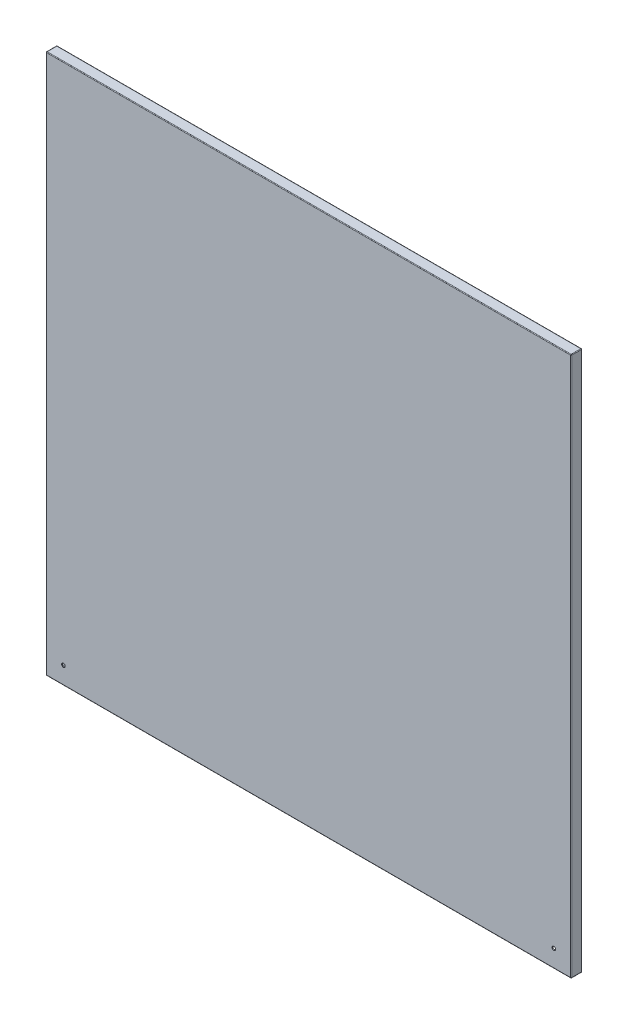
ISO-10303-21;
HEADER;
FILE_DESCRIPTION(('STEP AP214'),'2;1');
FILE_NAME('part.step','',(''),(''),'','','');
FILE_SCHEMA(('AUTOMOTIVE_DESIGN { 1 0 10303 214 1 1 1 1 }'));
ENDSEC;
DATA;
#1=APPLICATION_CONTEXT('core data for automotive mechanical design processes');
#2=APPLICATION_PROTOCOL_DEFINITION('international standard','automotive_design',2000,#1);
#3=PRODUCT_CONTEXT('',#1,'mechanical');
#4=PRODUCT('Part','Part','',(#3));
#5=PRODUCT_RELATED_PRODUCT_CATEGORY('part','',(#4));
#6=PRODUCT_DEFINITION_FORMATION('','',#4);
#7=PRODUCT_DEFINITION_CONTEXT('part definition',#1,'design');
#8=PRODUCT_DEFINITION('design','',#6,#7);
#9=PRODUCT_DEFINITION_SHAPE('','',#8);
#10=(LENGTH_UNIT() NAMED_UNIT(*) SI_UNIT(.MILLI.,.METRE.));
#11=(NAMED_UNIT(*) PLANE_ANGLE_UNIT() SI_UNIT($,.RADIAN.));
#12=(NAMED_UNIT(*) SI_UNIT($,.STERADIAN.) SOLID_ANGLE_UNIT());
#13=UNCERTAINTY_MEASURE_WITH_UNIT(LENGTH_MEASURE(1.E-05),#10,'distance_accuracy_value','');
#14=(GEOMETRIC_REPRESENTATION_CONTEXT(3) GLOBAL_UNCERTAINTY_ASSIGNED_CONTEXT((#13)) GLOBAL_UNIT_ASSIGNED_CONTEXT((#10,
#11,#12)) REPRESENTATION_CONTEXT('',''));
#15=CARTESIAN_POINT('',(0.,0.,0.));
#16=DIRECTION('',(0.,0.,1.));
#17=DIRECTION('',(1.,0.,0.));
#18=AXIS2_PLACEMENT_3D('',#15,#16,#17);
#19=CARTESIAN_POINT('',(-437.5,-450.,1.5));
#20=DIRECTION('',(1.,0.,0.));
#21=DIRECTION('',(0.,0.,-1.));
#22=AXIS2_PLACEMENT_3D('',#19,#20,#21);
#23=PLANE('',#22);
#24=DIRECTION('',(0.,-1.,0.));
#25=VECTOR('',#24,1.);
#26=CARTESIAN_POINT('',(-437.5,450.,0.5));
#27=LINE('',#26,#25);
#28=CARTESIAN_POINT('',(-437.5,-449.,0.5));
#29=VERTEX_POINT('',#28);
#30=CARTESIAN_POINT('',(-437.5,449.,0.5));
#31=VERTEX_POINT('',#30);
#32=EDGE_CURVE('E295',#29,#31,#27,.F.);
#33=ORIENTED_EDGE('',*,*,#32,.T.);
#34=DIRECTION('',(0.,0.,-1.));
#35=VECTOR('',#34,1.);
#36=CARTESIAN_POINT('',(-437.5,449.,1.5));
#37=LINE('',#36,#35);
#38=CARTESIAN_POINT('',(-437.5,449.,-15.5));
#39=VERTEX_POINT('',#38);
#40=EDGE_CURVE('E301',#31,#39,#37,.T.);
#41=ORIENTED_EDGE('',*,*,#40,.T.);
#42=DIRECTION('',(0.,1.,0.));
#43=VECTOR('',#42,1.);
#44=CARTESIAN_POINT('',(-437.5,-450.,-15.5));
#45=LINE('',#44,#43);
#46=CARTESIAN_POINT('',(-437.5,-449.,-15.5));
#47=VERTEX_POINT('',#46);
#48=EDGE_CURVE('E299',#39,#47,#45,.F.);
#49=ORIENTED_EDGE('',*,*,#48,.T.);
#50=DIRECTION('',(0.,0.,-1.));
#51=VECTOR('',#50,1.);
#52=CARTESIAN_POINT('',(-437.5,-449.,1.5));
#53=LINE('',#52,#51);
#54=EDGE_CURVE('E297',#47,#29,#53,.F.);
#55=ORIENTED_EDGE('',*,*,#54,.T.);
#56=EDGE_LOOP('',(#33,#41,#49,#55));
#57=FACE_BOUND('',#56,.T.);
#58=ADVANCED_FACE('F34',(#57),#23,.F.);
#59=CARTESIAN_POINT('',(437.5,-450.,1.5));
#60=DIRECTION('',(0.,1.,0.));
#61=DIRECTION('',(-1.,0.,0.));
#62=AXIS2_PLACEMENT_3D('',#59,#60,#61);
#63=PLANE('',#62);
#64=DIRECTION('',(0.,0.,-1.));
#65=VECTOR('',#64,1.);
#66=CARTESIAN_POINT('',(-436.5,-450.,1.5));
#67=LINE('',#66,#65);
#68=CARTESIAN_POINT('',(-436.5,-450.,0.5));
#69=VERTEX_POINT('',#68);
#70=CARTESIAN_POINT('',(-436.5,-450.,-15.5));
#71=VERTEX_POINT('',#70);
#72=EDGE_CURVE('E270',#69,#71,#67,.T.);
#73=ORIENTED_EDGE('',*,*,#72,.T.);
#74=DIRECTION('',(-1.,0.,0.));
#75=VECTOR('',#74,1.);
#76=CARTESIAN_POINT('',(437.5,-450.,-15.5));
#77=LINE('',#76,#75);
#78=CARTESIAN_POINT('',(436.5,-450.,-15.5));
#79=VERTEX_POINT('',#78);
#80=EDGE_CURVE('E274',#71,#79,#77,.F.);
#81=ORIENTED_EDGE('',*,*,#80,.T.);
#82=DIRECTION('',(0.,0.,-1.));
#83=VECTOR('',#82,1.);
#84=CARTESIAN_POINT('',(436.5,-450.,1.5));
#85=LINE('',#84,#83);
#86=CARTESIAN_POINT('',(436.5,-450.,0.5));
#87=VERTEX_POINT('',#86);
#88=EDGE_CURVE('E272',#79,#87,#85,.F.);
#89=ORIENTED_EDGE('',*,*,#88,.T.);
#90=DIRECTION('',(1.,0.,0.));
#91=VECTOR('',#90,1.);
#92=CARTESIAN_POINT('',(-437.5,-450.,0.5));
#93=LINE('',#92,#91);
#94=EDGE_CURVE('E268',#87,#69,#93,.F.);
#95=ORIENTED_EDGE('',*,*,#94,.T.);
#96=EDGE_LOOP('',(#73,#81,#89,#95));
#97=FACE_BOUND('',#96,.T.);
#98=ADVANCED_FACE('F404',(#97),#63,.F.);
#99=CARTESIAN_POINT('',(437.5,-450.,1.5));
#100=DIRECTION('',(-1.,0.,0.));
#101=DIRECTION('',(0.,0.,1.));
#102=AXIS2_PLACEMENT_3D('',#99,#100,#101);
#103=PLANE('',#102);
#104=DIRECTION('',(0.,0.,-1.));
#105=VECTOR('',#104,1.);
#106=CARTESIAN_POINT('',(437.5,-449.,1.5));
#107=LINE('',#106,#105);
#108=CARTESIAN_POINT('',(437.5,-449.,0.5));
#109=VERTEX_POINT('',#108);
#110=CARTESIAN_POINT('',(437.5,-449.,-15.5));
#111=VERTEX_POINT('',#110);
#112=EDGE_CURVE('E281',#109,#111,#107,.T.);
#113=ORIENTED_EDGE('',*,*,#112,.T.);
#114=DIRECTION('',(0.,-1.,0.));
#115=VECTOR('',#114,1.);
#116=CARTESIAN_POINT('',(437.5,-450.,-15.5));
#117=LINE('',#116,#115);
#118=CARTESIAN_POINT('',(437.5,449.,-15.5));
#119=VERTEX_POINT('',#118);
#120=EDGE_CURVE('E283',#111,#119,#117,.F.);
#121=ORIENTED_EDGE('',*,*,#120,.T.);
#122=DIRECTION('',(0.,0.,-1.));
#123=VECTOR('',#122,1.);
#124=CARTESIAN_POINT('',(437.5,449.,1.5));
#125=LINE('',#124,#123);
#126=CARTESIAN_POINT('',(437.5,449.,0.5));
#127=VERTEX_POINT('',#126);
#128=EDGE_CURVE('E277',#119,#127,#125,.F.);
#129=ORIENTED_EDGE('',*,*,#128,.T.);
#130=DIRECTION('',(0.,1.,0.));
#131=VECTOR('',#130,1.);
#132=CARTESIAN_POINT('',(437.5,-450.,0.5));
#133=LINE('',#132,#131);
#134=EDGE_CURVE('E279',#127,#109,#133,.F.);
#135=ORIENTED_EDGE('',*,*,#134,.T.);
#136=EDGE_LOOP('',(#113,#121,#129,#135));
#137=FACE_BOUND('',#136,.T.);
#138=ADVANCED_FACE('F397',(#137),#103,.F.);
#139=CARTESIAN_POINT('',(437.5,450.,1.5));
#140=DIRECTION('',(0.,-1.,0.));
#141=DIRECTION('',(1.,0.,0.));
#142=AXIS2_PLACEMENT_3D('',#139,#140,#141);
#143=PLANE('',#142);
#144=DIRECTION('',(0.,0.,-1.));
#145=VECTOR('',#144,1.);
#146=CARTESIAN_POINT('',(436.5,450.,1.5));
#147=LINE('',#146,#145);
#148=CARTESIAN_POINT('',(436.5,450.,0.5));
#149=VERTEX_POINT('',#148);
#150=CARTESIAN_POINT('',(436.5,450.,-15.5));
#151=VERTEX_POINT('',#150);
#152=EDGE_CURVE('E286',#149,#151,#147,.T.);
#153=ORIENTED_EDGE('',*,*,#152,.T.);
#154=DIRECTION('',(1.,0.,0.));
#155=VECTOR('',#154,1.);
#156=CARTESIAN_POINT('',(437.5,450.,-15.5));
#157=LINE('',#156,#155);
#158=CARTESIAN_POINT('',(-436.5,450.,-15.5));
#159=VERTEX_POINT('',#158);
#160=EDGE_CURVE('E292',#151,#159,#157,.F.);
#161=ORIENTED_EDGE('',*,*,#160,.T.);
#162=DIRECTION('',(0.,0.,-1.));
#163=VECTOR('',#162,1.);
#164=CARTESIAN_POINT('',(-436.5,450.,1.5));
#165=LINE('',#164,#163);
#166=CARTESIAN_POINT('',(-436.5,450.,0.5));
#167=VERTEX_POINT('',#166);
#168=EDGE_CURVE('E290',#159,#167,#165,.F.);
#169=ORIENTED_EDGE('',*,*,#168,.T.);
#170=DIRECTION('',(-1.,0.,0.));
#171=VECTOR('',#170,1.);
#172=CARTESIAN_POINT('',(437.5,450.,0.5));
#173=LINE('',#172,#171);
#174=EDGE_CURVE('E288',#167,#149,#173,.F.);
#175=ORIENTED_EDGE('',*,*,#174,.T.);
#176=EDGE_LOOP('',(#153,#161,#169,#175));
#177=FACE_BOUND('',#176,.T.);
#178=ADVANCED_FACE('F388',(#177),#143,.F.);
#179=CARTESIAN_POINT('',(0.,0.,1.5));
#180=DIRECTION('',(0.,0.,1.));
#181=DIRECTION('',(1.,0.,0.));
#182=AXIS2_PLACEMENT_3D('',#179,#180,#181);
#183=PLANE('',#182);
#184=DIRECTION('',(-1.,0.,0.));
#185=VECTOR('',#184,1.);
#186=CARTESIAN_POINT('',(-437.5,449.,1.5));
#187=LINE('',#186,#185);
#188=CARTESIAN_POINT('',(436.5,449.,1.5));
#189=VERTEX_POINT('',#188);
#190=CARTESIAN_POINT('',(-436.5,449.,1.5));
#191=VERTEX_POINT('',#190);
#192=EDGE_CURVE('E58',#189,#191,#187,.T.);
#193=ORIENTED_EDGE('',*,*,#192,.T.);
#194=DIRECTION('',(0.,-1.,0.));
#195=VECTOR('',#194,1.);
#196=CARTESIAN_POINT('',(-436.5,-450.,1.5));
#197=LINE('',#196,#195);
#198=CARTESIAN_POINT('',(-436.5,-449.,1.5));
#199=VERTEX_POINT('',#198);
#200=EDGE_CURVE('E11',#191,#199,#197,.T.);
#201=ORIENTED_EDGE('',*,*,#200,.T.);
#202=DIRECTION('',(1.,0.,0.));
#203=VECTOR('',#202,1.);
#204=CARTESIAN_POINT('',(437.5,-449.,1.5));
#205=LINE('',#204,#203);
#206=CARTESIAN_POINT('',(436.5,-449.,1.5));
#207=VERTEX_POINT('',#206);
#208=EDGE_CURVE('E43',#199,#207,#205,.T.);
#209=ORIENTED_EDGE('',*,*,#208,.T.);
#210=DIRECTION('',(0.,1.,0.));
#211=VECTOR('',#210,1.);
#212=CARTESIAN_POINT('',(436.5,450.,1.5));
#213=LINE('',#212,#211);
#214=EDGE_CURVE('E304',#207,#189,#213,.T.);
#215=ORIENTED_EDGE('',*,*,#214,.T.);
#216=EDGE_LOOP('',(#193,#201,#209,#215));
#217=FACE_BOUND('',#216,.T.);
#218=CARTESIAN_POINT('',(408.5,-421.,1.5));
#219=DIRECTION('',(0.,0.,1.));
#220=DIRECTION('',(1.,0.,0.));
#221=AXIS2_PLACEMENT_3D('',#218,#219,#220);
#222=CIRCLE('',#221,3.00000000000005);
#223=CARTESIAN_POINT('',(411.5,-421.,1.5));
#224=VERTEX_POINT('',#223);
#225=EDGE_CURVE('E259',#224,#224,#222,.T.);
#226=ORIENTED_EDGE('',*,*,#225,.F.);
#227=EDGE_LOOP('',(#226));
#228=FACE_BOUND('',#227,.T.);
#229=CARTESIAN_POINT('',(-408.5,-421.,1.5));
#230=DIRECTION('',(0.,0.,1.));
#231=DIRECTION('',(1.,0.,0.));
#232=AXIS2_PLACEMENT_3D('',#229,#230,#231);
#233=CIRCLE('',#232,3.00000000000005);
#234=CARTESIAN_POINT('',(-405.5,-421.,1.5));
#235=VERTEX_POINT('',#234);
#236=EDGE_CURVE('E255',#235,#235,#233,.T.);
#237=ORIENTED_EDGE('',*,*,#236,.F.);
#238=EDGE_LOOP('',(#237));
#239=FACE_BOUND('',#238,.T.);
#240=ADVANCED_FACE('F386',(#217,#228,#239),#183,.T.);
#241=CARTESIAN_POINT('',(0.,0.,-16.5));
#242=DIRECTION('',(0.,0.,1.));
#243=DIRECTION('',(1.,0.,0.));
#244=AXIS2_PLACEMENT_3D('',#241,#242,#243);
#245=PLANE('',#244);
#246=DIRECTION('',(0.,-1.,0.));
#247=VECTOR('',#246,1.);
#248=CARTESIAN_POINT('',(436.5,0.,-16.5));
#249=LINE('',#248,#247);
#250=CARTESIAN_POINT('',(436.5,449.,-16.5));
#251=VERTEX_POINT('',#250);
#252=CARTESIAN_POINT('',(436.5,-449.,-16.5));
#253=VERTEX_POINT('',#252);
#254=EDGE_CURVE('E263',#251,#253,#249,.T.);
#255=ORIENTED_EDGE('',*,*,#254,.T.);
#256=DIRECTION('',(-1.,0.,0.));
#257=VECTOR('',#256,1.);
#258=CARTESIAN_POINT('',(0.,-449.,-16.5));
#259=LINE('',#258,#257);
#260=CARTESIAN_POINT('',(-436.5,-449.,-16.5));
#261=VERTEX_POINT('',#260);
#262=EDGE_CURVE('E265',#253,#261,#259,.T.);
#263=ORIENTED_EDGE('',*,*,#262,.T.);
#264=DIRECTION('',(0.,1.,0.));
#265=VECTOR('',#264,1.);
#266=CARTESIAN_POINT('',(-436.5,0.,-16.5));
#267=LINE('',#266,#265);
#268=CARTESIAN_POINT('',(-436.5,449.,-16.5));
#269=VERTEX_POINT('',#268);
#270=EDGE_CURVE('E252',#261,#269,#267,.T.);
#271=ORIENTED_EDGE('',*,*,#270,.T.);
#272=DIRECTION('',(1.,0.,0.));
#273=VECTOR('',#272,1.);
#274=CARTESIAN_POINT('',(0.,449.,-16.5));
#275=LINE('',#274,#273);
#276=EDGE_CURVE('E261',#269,#251,#275,.T.);
#277=ORIENTED_EDGE('',*,*,#276,.T.);
#278=EDGE_LOOP('',(#255,#263,#271,#277));
#279=FACE_BOUND('',#278,.T.);
#280=DIRECTION('',(0.,1.,0.));
#281=VECTOR('',#280,1.);
#282=CARTESIAN_POINT('',(-422.5,-440.,-16.5));
#283=LINE('',#282,#281);
#284=CARTESIAN_POINT('',(-422.5,-440.,-16.5));
#285=VERTEX_POINT('',#284);
#286=CARTESIAN_POINT('',(-422.5,440.,-16.5));
#287=VERTEX_POINT('',#286);
#288=EDGE_CURVE('E176',#285,#287,#283,.T.);
#289=ORIENTED_EDGE('',*,*,#288,.F.);
#290=DIRECTION('',(-1.,0.,0.));
#291=VECTOR('',#290,1.);
#292=CARTESIAN_POINT('',(422.5,-440.,-16.5));
#293=LINE('',#292,#291);
#294=CARTESIAN_POINT('',(422.5,-440.,-16.5));
#295=VERTEX_POINT('',#294);
#296=EDGE_CURVE('E202',#295,#285,#293,.T.);
#297=ORIENTED_EDGE('',*,*,#296,.F.);
#298=DIRECTION('',(0.,-1.,0.));
#299=VECTOR('',#298,1.);
#300=CARTESIAN_POINT('',(422.5,-440.,-16.5));
#301=LINE('',#300,#299);
#302=CARTESIAN_POINT('',(422.5,440.,-16.5));
#303=VERTEX_POINT('',#302);
#304=EDGE_CURVE('E200',#303,#295,#301,.T.);
#305=ORIENTED_EDGE('',*,*,#304,.F.);
#306=DIRECTION('',(1.,0.,0.));
#307=VECTOR('',#306,1.);
#308=CARTESIAN_POINT('',(422.5,440.,-16.5));
#309=LINE('',#308,#307);
#310=EDGE_CURVE('E186',#287,#303,#309,.T.);
#311=ORIENTED_EDGE('',*,*,#310,.F.);
#312=EDGE_LOOP('',(#289,#297,#305,#311));
#313=FACE_BOUND('',#312,.T.);
#314=ADVANCED_FACE('F198',(#279,#313),#245,.F.);
#315=CARTESIAN_POINT('',(0.,0.,-15.));
#316=DIRECTION('',(0.,0.,1.));
#317=DIRECTION('',(1.,0.,0.));
#318=AXIS2_PLACEMENT_3D('',#315,#316,#317);
#319=PLANE('',#318);
#320=DIRECTION('',(1.,0.,0.));
#321=VECTOR('',#320,1.);
#322=CARTESIAN_POINT('',(436.,448.5,-15.));
#323=LINE('',#322,#321);
#324=CARTESIAN_POINT('',(-436.,448.5,-15.));
#325=VERTEX_POINT('',#324);
#326=CARTESIAN_POINT('',(436.,448.5,-15.));
#327=VERTEX_POINT('',#326);
#328=EDGE_CURVE('E223',#325,#327,#323,.T.);
#329=ORIENTED_EDGE('',*,*,#328,.F.);
#330=DIRECTION('',(0.,1.,0.));
#331=VECTOR('',#330,1.);
#332=CARTESIAN_POINT('',(-436.,-448.5,-15.));
#333=LINE('',#332,#331);
#334=CARTESIAN_POINT('',(-436.,-448.5,-15.));
#335=VERTEX_POINT('',#334);
#336=EDGE_CURVE('E220',#335,#325,#333,.T.);
#337=ORIENTED_EDGE('',*,*,#336,.F.);
#338=DIRECTION('',(-1.,0.,0.));
#339=VECTOR('',#338,1.);
#340=CARTESIAN_POINT('',(436.,-448.5,-15.));
#341=LINE('',#340,#339);
#342=CARTESIAN_POINT('',(436.,-448.5,-15.));
#343=VERTEX_POINT('',#342);
#344=EDGE_CURVE('E230',#343,#335,#341,.T.);
#345=ORIENTED_EDGE('',*,*,#344,.F.);
#346=DIRECTION('',(0.,-1.,0.));
#347=VECTOR('',#346,1.);
#348=CARTESIAN_POINT('',(436.,-448.5,-15.));
#349=LINE('',#348,#347);
#350=EDGE_CURVE('E227',#327,#343,#349,.T.);
#351=ORIENTED_EDGE('',*,*,#350,.F.);
#352=EDGE_LOOP('',(#329,#337,#345,#351));
#353=FACE_BOUND('',#352,.T.);
#354=DIRECTION('',(-1.,0.,0.));
#355=VECTOR('',#354,1.);
#356=CARTESIAN_POINT('',(422.5,-440.,-15.));
#357=LINE('',#356,#355);
#358=CARTESIAN_POINT('',(422.5,-440.,-15.));
#359=VERTEX_POINT('',#358);
#360=CARTESIAN_POINT('',(-422.5,-440.,-15.));
#361=VERTEX_POINT('',#360);
#362=EDGE_CURVE('E187',#359,#361,#357,.T.);
#363=ORIENTED_EDGE('',*,*,#362,.T.);
#364=DIRECTION('',(0.,1.,0.));
#365=VECTOR('',#364,1.);
#366=CARTESIAN_POINT('',(-422.5,-440.,-15.));
#367=LINE('',#366,#365);
#368=CARTESIAN_POINT('',(-422.5,440.,-15.));
#369=VERTEX_POINT('',#368);
#370=EDGE_CURVE('E207',#361,#369,#367,.T.);
#371=ORIENTED_EDGE('',*,*,#370,.T.);
#372=DIRECTION('',(1.,0.,0.));
#373=VECTOR('',#372,1.);
#374=CARTESIAN_POINT('',(422.5,440.,-15.));
#375=LINE('',#374,#373);
#376=CARTESIAN_POINT('',(422.5,440.,-15.));
#377=VERTEX_POINT('',#376);
#378=EDGE_CURVE('E193',#369,#377,#375,.T.);
#379=ORIENTED_EDGE('',*,*,#378,.T.);
#380=DIRECTION('',(0.,-1.,0.));
#381=VECTOR('',#380,1.);
#382=CARTESIAN_POINT('',(422.5,-440.,-15.));
#383=LINE('',#382,#381);
#384=EDGE_CURVE('E211',#377,#359,#383,.T.);
#385=ORIENTED_EDGE('',*,*,#384,.T.);
#386=EDGE_LOOP('',(#363,#371,#379,#385));
#387=FACE_BOUND('',#386,.T.);
#388=ADVANCED_FACE('F394',(#353,#387),#319,.T.);
#389=CARTESIAN_POINT('',(-422.5,-440.,-16.5));
#390=DIRECTION('',(1.,0.,0.));
#391=DIRECTION('',(0.,0.,-1.));
#392=AXIS2_PLACEMENT_3D('',#389,#390,#391);
#393=PLANE('',#392);
#394=ORIENTED_EDGE('',*,*,#370,.F.);
#395=DIRECTION('',(0.,0.,1.));
#396=VECTOR('',#395,1.);
#397=CARTESIAN_POINT('',(-422.5,-440.,-16.5));
#398=LINE('',#397,#396);
#399=EDGE_CURVE('E182',#285,#361,#398,.T.);
#400=ORIENTED_EDGE('',*,*,#399,.F.);
#401=ORIENTED_EDGE('',*,*,#288,.T.);
#402=DIRECTION('',(0.,0.,1.));
#403=VECTOR('',#402,1.);
#404=CARTESIAN_POINT('',(-422.5,440.,-16.5));
#405=LINE('',#404,#403);
#406=EDGE_CURVE('E179',#287,#369,#405,.T.);
#407=ORIENTED_EDGE('',*,*,#406,.T.);
#408=EDGE_LOOP('',(#394,#400,#401,#407));
#409=FACE_BOUND('',#408,.T.);
#410=ADVANCED_FACE('F178',(#409),#393,.T.);
#411=CARTESIAN_POINT('',(422.5,440.,-16.5));
#412=DIRECTION('',(0.,-1.,0.));
#413=DIRECTION('',(0.,0.,-1.));
#414=AXIS2_PLACEMENT_3D('',#411,#412,#413);
#415=PLANE('',#414);
#416=ORIENTED_EDGE('',*,*,#378,.F.);
#417=ORIENTED_EDGE('',*,*,#406,.F.);
#418=ORIENTED_EDGE('',*,*,#310,.T.);
#419=DIRECTION('',(0.,0.,1.));
#420=VECTOR('',#419,1.);
#421=CARTESIAN_POINT('',(422.5,440.,-16.5));
#422=LINE('',#421,#420);
#423=EDGE_CURVE('E195',#303,#377,#422,.T.);
#424=ORIENTED_EDGE('',*,*,#423,.T.);
#425=EDGE_LOOP('',(#416,#417,#418,#424));
#426=FACE_BOUND('',#425,.T.);
#427=ADVANCED_FACE('F190',(#426),#415,.T.);
#428=CARTESIAN_POINT('',(422.5,-440.,-16.5));
#429=DIRECTION('',(-1.,0.,0.));
#430=DIRECTION('',(0.,0.,1.));
#431=AXIS2_PLACEMENT_3D('',#428,#429,#430);
#432=PLANE('',#431);
#433=ORIENTED_EDGE('',*,*,#384,.F.);
#434=ORIENTED_EDGE('',*,*,#423,.F.);
#435=ORIENTED_EDGE('',*,*,#304,.T.);
#436=DIRECTION('',(0.,0.,1.));
#437=VECTOR('',#436,1.);
#438=CARTESIAN_POINT('',(422.5,-440.,-16.5));
#439=LINE('',#438,#437);
#440=EDGE_CURVE('E217',#295,#359,#439,.T.);
#441=ORIENTED_EDGE('',*,*,#440,.T.);
#442=EDGE_LOOP('',(#433,#434,#435,#441));
#443=FACE_BOUND('',#442,.T.);
#444=ADVANCED_FACE('F543',(#443),#432,.T.);
#445=CARTESIAN_POINT('',(422.5,-440.,-16.5));
#446=DIRECTION('',(0.,1.,0.));
#447=DIRECTION('',(0.,0.,1.));
#448=AXIS2_PLACEMENT_3D('',#445,#446,#447);
#449=PLANE('',#448);
#450=ORIENTED_EDGE('',*,*,#362,.F.);
#451=ORIENTED_EDGE('',*,*,#440,.F.);
#452=ORIENTED_EDGE('',*,*,#296,.T.);
#453=ORIENTED_EDGE('',*,*,#399,.T.);
#454=EDGE_LOOP('',(#450,#451,#452,#453));
#455=FACE_BOUND('',#454,.T.);
#456=ADVANCED_FACE('F534',(#455),#449,.T.);
#457=CARTESIAN_POINT('',(0.,0.,0.));
#458=DIRECTION('',(0.,0.,1.));
#459=DIRECTION('',(1.,0.,0.));
#460=AXIS2_PLACEMENT_3D('',#457,#458,#459);
#461=PLANE('',#460);
#462=CARTESIAN_POINT('',(408.5,-421.,0.));
#463=DIRECTION('',(0.,0.,1.));
#464=DIRECTION('',(1.,0.,0.));
#465=AXIS2_PLACEMENT_3D('',#462,#463,#464);
#466=CIRCLE('',#465,3.00000000000005);
#467=CARTESIAN_POINT('',(411.5,-421.,0.));
#468=VERTEX_POINT('',#467);
#469=EDGE_CURVE('E256',#468,#468,#466,.T.);
#470=ORIENTED_EDGE('',*,*,#469,.T.);
#471=EDGE_LOOP('',(#470));
#472=FACE_BOUND('',#471,.T.);
#473=CARTESIAN_POINT('',(-408.5,-421.,0.));
#474=DIRECTION('',(0.,0.,1.));
#475=DIRECTION('',(1.,0.,0.));
#476=AXIS2_PLACEMENT_3D('',#473,#474,#475);
#477=CIRCLE('',#476,3.00000000000005);
#478=CARTESIAN_POINT('',(-405.5,-421.,0.));
#479=VERTEX_POINT('',#478);
#480=EDGE_CURVE('E209',#479,#479,#477,.T.);
#481=ORIENTED_EDGE('',*,*,#480,.T.);
#482=EDGE_LOOP('',(#481));
#483=FACE_BOUND('',#482,.T.);
#484=DIRECTION('',(-1.,0.,0.));
#485=VECTOR('',#484,1.);
#486=CARTESIAN_POINT('',(436.,-448.5,0.));
#487=LINE('',#486,#485);
#488=CARTESIAN_POINT('',(436.,-448.5,0.));
#489=VERTEX_POINT('',#488);
#490=CARTESIAN_POINT('',(-436.,-448.5,0.));
#491=VERTEX_POINT('',#490);
#492=EDGE_CURVE('E224',#489,#491,#487,.T.);
#493=ORIENTED_EDGE('',*,*,#492,.T.);
#494=DIRECTION('',(0.,1.,0.));
#495=VECTOR('',#494,1.);
#496=CARTESIAN_POINT('',(-436.,-448.5,0.));
#497=LINE('',#496,#495);
#498=CARTESIAN_POINT('',(-436.,448.5,0.));
#499=VERTEX_POINT('',#498);
#500=EDGE_CURVE('E194',#491,#499,#497,.T.);
#501=ORIENTED_EDGE('',*,*,#500,.T.);
#502=DIRECTION('',(1.,0.,0.));
#503=VECTOR('',#502,1.);
#504=CARTESIAN_POINT('',(436.,448.5,0.));
#505=LINE('',#504,#503);
#506=CARTESIAN_POINT('',(436.,448.5,0.));
#507=VERTEX_POINT('',#506);
#508=EDGE_CURVE('E236',#499,#507,#505,.T.);
#509=ORIENTED_EDGE('',*,*,#508,.T.);
#510=DIRECTION('',(0.,-1.,0.));
#511=VECTOR('',#510,1.);
#512=CARTESIAN_POINT('',(436.,-448.5,0.));
#513=LINE('',#512,#511);
#514=EDGE_CURVE('E239',#507,#489,#513,.T.);
#515=ORIENTED_EDGE('',*,*,#514,.T.);
#516=EDGE_LOOP('',(#493,#501,#509,#515));
#517=FACE_BOUND('',#516,.T.);
#518=ADVANCED_FACE('F531',(#472,#483,#517),#461,.F.);
#519=CARTESIAN_POINT('',(436.,-448.5,-15.));
#520=DIRECTION('',(0.,1.,0.));
#521=DIRECTION('',(0.,0.,1.));
#522=AXIS2_PLACEMENT_3D('',#519,#520,#521);
#523=PLANE('',#522);
#524=ORIENTED_EDGE('',*,*,#492,.F.);
#525=DIRECTION('',(0.,0.,1.));
#526=VECTOR('',#525,1.);
#527=CARTESIAN_POINT('',(436.,-448.5,-15.));
#528=LINE('',#527,#526);
#529=EDGE_CURVE('E245',#343,#489,#528,.T.);
#530=ORIENTED_EDGE('',*,*,#529,.F.);
#531=ORIENTED_EDGE('',*,*,#344,.T.);
#532=DIRECTION('',(0.,0.,1.));
#533=VECTOR('',#532,1.);
#534=CARTESIAN_POINT('',(-436.,-448.5,-15.));
#535=LINE('',#534,#533);
#536=EDGE_CURVE('E233',#335,#491,#535,.T.);
#537=ORIENTED_EDGE('',*,*,#536,.T.);
#538=EDGE_LOOP('',(#524,#530,#531,#537));
#539=FACE_BOUND('',#538,.T.);
#540=ADVANCED_FACE('F533',(#539),#523,.T.);
#541=CARTESIAN_POINT('',(436.,-448.5,-15.));
#542=DIRECTION('',(-1.,0.,0.));
#543=DIRECTION('',(0.,0.,1.));
#544=AXIS2_PLACEMENT_3D('',#541,#542,#543);
#545=PLANE('',#544);
#546=ORIENTED_EDGE('',*,*,#514,.F.);
#547=DIRECTION('',(0.,0.,1.));
#548=VECTOR('',#547,1.);
#549=CARTESIAN_POINT('',(436.,448.5,-15.));
#550=LINE('',#549,#548);
#551=EDGE_CURVE('E247',#327,#507,#550,.T.);
#552=ORIENTED_EDGE('',*,*,#551,.F.);
#553=ORIENTED_EDGE('',*,*,#350,.T.);
#554=ORIENTED_EDGE('',*,*,#529,.T.);
#555=EDGE_LOOP('',(#546,#552,#553,#554));
#556=FACE_BOUND('',#555,.T.);
#557=ADVANCED_FACE('F540',(#556),#545,.T.);
#558=CARTESIAN_POINT('',(436.,448.5,-15.));
#559=DIRECTION('',(0.,-1.,0.));
#560=DIRECTION('',(0.,0.,-1.));
#561=AXIS2_PLACEMENT_3D('',#558,#559,#560);
#562=PLANE('',#561);
#563=ORIENTED_EDGE('',*,*,#508,.F.);
#564=DIRECTION('',(0.,0.,1.));
#565=VECTOR('',#564,1.);
#566=CARTESIAN_POINT('',(-436.,448.5,-15.));
#567=LINE('',#566,#565);
#568=EDGE_CURVE('E249',#325,#499,#567,.T.);
#569=ORIENTED_EDGE('',*,*,#568,.F.);
#570=ORIENTED_EDGE('',*,*,#328,.T.);
#571=ORIENTED_EDGE('',*,*,#551,.T.);
#572=EDGE_LOOP('',(#563,#569,#570,#571));
#573=FACE_BOUND('',#572,.T.);
#574=ADVANCED_FACE('F559',(#573),#562,.T.);
#575=CARTESIAN_POINT('',(-436.,-448.5,-15.));
#576=DIRECTION('',(1.,0.,0.));
#577=DIRECTION('',(0.,0.,-1.));
#578=AXIS2_PLACEMENT_3D('',#575,#576,#577);
#579=PLANE('',#578);
#580=ORIENTED_EDGE('',*,*,#500,.F.);
#581=ORIENTED_EDGE('',*,*,#536,.F.);
#582=ORIENTED_EDGE('',*,*,#336,.T.);
#583=ORIENTED_EDGE('',*,*,#568,.T.);
#584=EDGE_LOOP('',(#580,#581,#582,#583));
#585=FACE_BOUND('',#584,.T.);
#586=ADVANCED_FACE('F556',(#585),#579,.T.);
#587=CARTESIAN_POINT('',(-408.5,-421.,-16.5));
#588=DIRECTION('',(0.,0.,1.));
#589=DIRECTION('',(1.,0.,0.));
#590=AXIS2_PLACEMENT_3D('',#587,#588,#589);
#591=CYLINDRICAL_SURFACE('',#590,3.00000000000005);
#592=ORIENTED_EDGE('',*,*,#236,.T.);
#593=EDGE_LOOP('',(#592));
#594=FACE_BOUND('',#593,.T.);
#595=ORIENTED_EDGE('',*,*,#480,.F.);
#596=EDGE_LOOP('',(#595));
#597=FACE_BOUND('',#596,.T.);
#598=ADVANCED_FACE('F383',(#594,#597),#591,.F.);
#599=CARTESIAN_POINT('',(408.5,-421.,-16.5));
#600=DIRECTION('',(0.,0.,1.));
#601=DIRECTION('',(1.,0.,0.));
#602=AXIS2_PLACEMENT_3D('',#599,#600,#601);
#603=CYLINDRICAL_SURFACE('',#602,3.00000000000005);
#604=ORIENTED_EDGE('',*,*,#225,.T.);
#605=EDGE_LOOP('',(#604));
#606=FACE_BOUND('',#605,.T.);
#607=ORIENTED_EDGE('',*,*,#469,.F.);
#608=EDGE_LOOP('',(#607));
#609=FACE_BOUND('',#608,.T.);
#610=ADVANCED_FACE('F488',(#606,#609),#603,.F.);
#611=CARTESIAN_POINT('',(0.,449.,0.5));
#612=DIRECTION('',(1.,0.,0.));
#613=DIRECTION('',(0.,1.,0.));
#614=AXIS2_PLACEMENT_3D('',#611,#612,#613);
#615=CYLINDRICAL_SURFACE('',#614,1.);
#616=CARTESIAN_POINT('',(436.5,449.,0.5));
#617=DIRECTION('',(1.,0.,0.));
#618=DIRECTION('',(0.,0.,-1.));
#619=AXIS2_PLACEMENT_3D('',#616,#617,#618);
#620=CIRCLE('',#619,1.);
#621=EDGE_CURVE('E38',#149,#189,#620,.T.);
#622=ORIENTED_EDGE('',*,*,#621,.F.);
#623=ORIENTED_EDGE('',*,*,#174,.F.);
#624=CARTESIAN_POINT('',(-436.5,449.,0.5));
#625=DIRECTION('',(-1.,0.,0.));
#626=DIRECTION('',(0.,0.,1.));
#627=AXIS2_PLACEMENT_3D('',#624,#625,#626);
#628=CIRCLE('',#627,1.);
#629=EDGE_CURVE('E366',#191,#167,#628,.T.);
#630=ORIENTED_EDGE('',*,*,#629,.F.);
#631=ORIENTED_EDGE('',*,*,#192,.F.);
#632=EDGE_LOOP('',(#622,#623,#630,#631));
#633=FACE_BOUND('',#632,.T.);
#634=ADVANCED_FACE('F36',(#633),#615,.T.);
#635=CARTESIAN_POINT('',(436.5,449.,0.5));
#636=DIRECTION('',(0.,0.,1.));
#637=DIRECTION('',(1.,0.,0.));
#638=AXIS2_PLACEMENT_3D('',#635,#636,#637);
#639=SPHERICAL_SURFACE('',#638,1.);
#640=CARTESIAN_POINT('',(436.5,449.,0.5));
#641=DIRECTION('',(0.,0.,1.));
#642=DIRECTION('',(1.,0.,0.));
#643=AXIS2_PLACEMENT_3D('',#640,#641,#642);
#644=CIRCLE('',#643,1.);
#645=EDGE_CURVE('E361',#149,#127,#644,.F.);
#646=ORIENTED_EDGE('',*,*,#645,.F.);
#647=ORIENTED_EDGE('',*,*,#621,.T.);
#648=CARTESIAN_POINT('',(436.5,449.,0.5));
#649=DIRECTION('',(0.,1.,0.));
#650=DIRECTION('',(0.,0.,1.));
#651=AXIS2_PLACEMENT_3D('',#648,#649,#650);
#652=CIRCLE('',#651,1.);
#653=EDGE_CURVE('E364',#127,#189,#652,.F.);
#654=ORIENTED_EDGE('',*,*,#653,.F.);
#655=EDGE_LOOP('',(#646,#647,#654));
#656=FACE_BOUND('',#655,.T.);
#657=ADVANCED_FACE('F483',(#656),#639,.T.);
#658=CARTESIAN_POINT('',(-436.5,449.,0.5));
#659=DIRECTION('',(0.,0.,1.));
#660=DIRECTION('',(1.,0.,0.));
#661=AXIS2_PLACEMENT_3D('',#658,#659,#660);
#662=SPHERICAL_SURFACE('',#661,1.);
#663=CARTESIAN_POINT('',(-436.5,449.,0.5));
#664=DIRECTION('',(0.,1.,0.));
#665=DIRECTION('',(0.,0.,1.));
#666=AXIS2_PLACEMENT_3D('',#663,#664,#665);
#667=CIRCLE('',#666,1.);
#668=EDGE_CURVE('E355',#191,#31,#667,.F.);
#669=ORIENTED_EDGE('',*,*,#668,.F.);
#670=ORIENTED_EDGE('',*,*,#629,.T.);
#671=CARTESIAN_POINT('',(-436.5,449.,0.5));
#672=DIRECTION('',(0.,0.,1.));
#673=DIRECTION('',(1.,0.,0.));
#674=AXIS2_PLACEMENT_3D('',#671,#672,#673);
#675=CIRCLE('',#674,1.);
#676=EDGE_CURVE('E358',#31,#167,#675,.F.);
#677=ORIENTED_EDGE('',*,*,#676,.F.);
#678=EDGE_LOOP('',(#669,#670,#677));
#679=FACE_BOUND('',#678,.T.);
#680=ADVANCED_FACE('F480',(#679),#662,.T.);
#681=CARTESIAN_POINT('',(436.5,0.,0.5));
#682=DIRECTION('',(0.,-1.,0.));
#683=DIRECTION('',(0.,0.,-1.));
#684=AXIS2_PLACEMENT_3D('',#681,#682,#683);
#685=CYLINDRICAL_SURFACE('',#684,1.);
#686=ORIENTED_EDGE('',*,*,#653,.T.);
#687=ORIENTED_EDGE('',*,*,#214,.F.);
#688=CARTESIAN_POINT('',(436.5,-449.,0.5));
#689=DIRECTION('',(0.,-1.,0.));
#690=DIRECTION('',(0.,0.,-1.));
#691=AXIS2_PLACEMENT_3D('',#688,#689,#690);
#692=CIRCLE('',#691,1.);
#693=EDGE_CURVE('E349',#109,#207,#692,.T.);
#694=ORIENTED_EDGE('',*,*,#693,.F.);
#695=ORIENTED_EDGE('',*,*,#134,.F.);
#696=EDGE_LOOP('',(#686,#687,#694,#695));
#697=FACE_BOUND('',#696,.T.);
#698=ADVANCED_FACE('F476',(#697),#685,.T.);
#699=CARTESIAN_POINT('',(436.5,449.,1.5));
#700=DIRECTION('',(0.,0.,-1.));
#701=DIRECTION('',(-1.,0.,0.));
#702=AXIS2_PLACEMENT_3D('',#699,#700,#701);
#703=CYLINDRICAL_SURFACE('',#702,1.);
#704=ORIENTED_EDGE('',*,*,#645,.T.);
#705=ORIENTED_EDGE('',*,*,#128,.F.);
#706=CARTESIAN_POINT('',(436.5,449.,-15.5));
#707=DIRECTION('',(0.,0.,-1.));
#708=DIRECTION('',(-1.,0.,0.));
#709=AXIS2_PLACEMENT_3D('',#706,#707,#708);
#710=CIRCLE('',#709,1.);
#711=EDGE_CURVE('E346',#151,#119,#710,.T.);
#712=ORIENTED_EDGE('',*,*,#711,.F.);
#713=ORIENTED_EDGE('',*,*,#152,.F.);
#714=EDGE_LOOP('',(#704,#705,#712,#713));
#715=FACE_BOUND('',#714,.T.);
#716=ADVANCED_FACE('F472',(#715),#703,.T.);
#717=CARTESIAN_POINT('',(0.,449.,-15.5));
#718=DIRECTION('',(1.,0.,0.));
#719=DIRECTION('',(0.,1.,0.));
#720=AXIS2_PLACEMENT_3D('',#717,#718,#719);
#721=CYLINDRICAL_SURFACE('',#720,1.);
#722=CARTESIAN_POINT('',(-436.5,449.,-15.5));
#723=DIRECTION('',(-1.,0.,0.));
#724=DIRECTION('',(0.,0.,1.));
#725=AXIS2_PLACEMENT_3D('',#722,#723,#724);
#726=CIRCLE('',#725,1.);
#727=EDGE_CURVE('E340',#159,#269,#726,.T.);
#728=ORIENTED_EDGE('',*,*,#727,.F.);
#729=ORIENTED_EDGE('',*,*,#160,.F.);
#730=CARTESIAN_POINT('',(436.5,449.,-15.5));
#731=DIRECTION('',(1.,0.,0.));
#732=DIRECTION('',(0.,0.,-1.));
#733=AXIS2_PLACEMENT_3D('',#730,#731,#732);
#734=CIRCLE('',#733,1.);
#735=EDGE_CURVE('E343',#251,#151,#734,.T.);
#736=ORIENTED_EDGE('',*,*,#735,.F.);
#737=ORIENTED_EDGE('',*,*,#276,.F.);
#738=EDGE_LOOP('',(#728,#729,#736,#737));
#739=FACE_BOUND('',#738,.T.);
#740=ADVANCED_FACE('F468',(#739),#721,.T.);
#741=CARTESIAN_POINT('',(-436.5,449.,1.5));
#742=DIRECTION('',(0.,0.,-1.));
#743=DIRECTION('',(-1.,0.,0.));
#744=AXIS2_PLACEMENT_3D('',#741,#742,#743);
#745=CYLINDRICAL_SURFACE('',#744,1.);
#746=ORIENTED_EDGE('',*,*,#676,.T.);
#747=ORIENTED_EDGE('',*,*,#168,.F.);
#748=CARTESIAN_POINT('',(-436.5,449.,-15.5));
#749=DIRECTION('',(0.,0.,-1.));
#750=DIRECTION('',(-1.,0.,0.));
#751=AXIS2_PLACEMENT_3D('',#748,#749,#750);
#752=CIRCLE('',#751,1.);
#753=EDGE_CURVE('E338',#39,#159,#752,.T.);
#754=ORIENTED_EDGE('',*,*,#753,.F.);
#755=ORIENTED_EDGE('',*,*,#40,.F.);
#756=EDGE_LOOP('',(#746,#747,#754,#755));
#757=FACE_BOUND('',#756,.T.);
#758=ADVANCED_FACE('F464',(#757),#745,.T.);
#759=CARTESIAN_POINT('',(-436.5,0.,0.5));
#760=DIRECTION('',(0.,1.,0.));
#761=DIRECTION('',(0.,0.,1.));
#762=AXIS2_PLACEMENT_3D('',#759,#760,#761);
#763=CYLINDRICAL_SURFACE('',#762,1.);
#764=ORIENTED_EDGE('',*,*,#668,.T.);
#765=ORIENTED_EDGE('',*,*,#32,.F.);
#766=CARTESIAN_POINT('',(-436.5,-449.,0.5));
#767=DIRECTION('',(0.,-1.,0.));
#768=DIRECTION('',(0.,0.,-1.));
#769=AXIS2_PLACEMENT_3D('',#766,#767,#768);
#770=CIRCLE('',#769,1.);
#771=EDGE_CURVE('E336',#199,#29,#770,.T.);
#772=ORIENTED_EDGE('',*,*,#771,.F.);
#773=ORIENTED_EDGE('',*,*,#200,.F.);
#774=EDGE_LOOP('',(#764,#765,#772,#773));
#775=FACE_BOUND('',#774,.T.);
#776=ADVANCED_FACE('F460',(#775),#763,.T.);
#777=CARTESIAN_POINT('',(0.,-449.,0.5));
#778=DIRECTION('',(-1.,0.,0.));
#779=DIRECTION('',(0.,-1.,0.));
#780=AXIS2_PLACEMENT_3D('',#777,#778,#779);
#781=CYLINDRICAL_SURFACE('',#780,1.);
#782=CARTESIAN_POINT('',(436.5,-449.,0.5));
#783=DIRECTION('',(1.,0.,0.));
#784=DIRECTION('',(0.,0.,-1.));
#785=AXIS2_PLACEMENT_3D('',#782,#783,#784);
#786=CIRCLE('',#785,1.);
#787=EDGE_CURVE('E352',#207,#87,#786,.T.);
#788=ORIENTED_EDGE('',*,*,#787,.F.);
#789=ORIENTED_EDGE('',*,*,#208,.F.);
#790=CARTESIAN_POINT('',(-436.5,-449.,0.5));
#791=DIRECTION('',(-1.,0.,0.));
#792=DIRECTION('',(0.,0.,1.));
#793=AXIS2_PLACEMENT_3D('',#790,#791,#792);
#794=CIRCLE('',#793,1.);
#795=EDGE_CURVE('E51',#69,#199,#794,.T.);
#796=ORIENTED_EDGE('',*,*,#795,.F.);
#797=ORIENTED_EDGE('',*,*,#94,.F.);
#798=EDGE_LOOP('',(#788,#789,#796,#797));
#799=FACE_BOUND('',#798,.T.);
#800=ADVANCED_FACE('F456',(#799),#781,.T.);
#801=CARTESIAN_POINT('',(436.5,-449.,0.5));
#802=DIRECTION('',(0.,0.,1.));
#803=DIRECTION('',(1.,0.,0.));
#804=AXIS2_PLACEMENT_3D('',#801,#802,#803);
#805=SPHERICAL_SURFACE('',#804,1.);
#806=ORIENTED_EDGE('',*,*,#693,.T.);
#807=ORIENTED_EDGE('',*,*,#787,.T.);
#808=CARTESIAN_POINT('',(436.5,-449.,0.5));
#809=DIRECTION('',(0.,0.,1.));
#810=DIRECTION('',(1.,0.,0.));
#811=AXIS2_PLACEMENT_3D('',#808,#809,#810);
#812=CIRCLE('',#811,1.);
#813=EDGE_CURVE('E332',#109,#87,#812,.F.);
#814=ORIENTED_EDGE('',*,*,#813,.F.);
#815=EDGE_LOOP('',(#806,#807,#814));
#816=FACE_BOUND('',#815,.T.);
#817=ADVANCED_FACE('F452',(#816),#805,.T.);
#818=CARTESIAN_POINT('',(436.5,449.,-15.5));
#819=DIRECTION('',(0.,0.,1.));
#820=DIRECTION('',(1.,0.,0.));
#821=AXIS2_PLACEMENT_3D('',#818,#819,#820);
#822=SPHERICAL_SURFACE('',#821,1.);
#823=ORIENTED_EDGE('',*,*,#735,.T.);
#824=ORIENTED_EDGE('',*,*,#711,.T.);
#825=CARTESIAN_POINT('',(436.5,449.,-15.5));
#826=DIRECTION('',(0.,1.,0.));
#827=DIRECTION('',(0.,0.,1.));
#828=AXIS2_PLACEMENT_3D('',#825,#826,#827);
#829=CIRCLE('',#828,1.);
#830=EDGE_CURVE('E330',#251,#119,#829,.F.);
#831=ORIENTED_EDGE('',*,*,#830,.F.);
#832=EDGE_LOOP('',(#823,#824,#831));
#833=FACE_BOUND('',#832,.T.);
#834=ADVANCED_FACE('F448',(#833),#822,.T.);
#835=CARTESIAN_POINT('',(-436.5,449.,-15.5));
#836=DIRECTION('',(0.,0.,1.));
#837=DIRECTION('',(1.,0.,0.));
#838=AXIS2_PLACEMENT_3D('',#835,#836,#837);
#839=SPHERICAL_SURFACE('',#838,1.);
#840=ORIENTED_EDGE('',*,*,#753,.T.);
#841=ORIENTED_EDGE('',*,*,#727,.T.);
#842=CARTESIAN_POINT('',(-436.5,449.,-15.5));
#843=DIRECTION('',(0.,1.,0.));
#844=DIRECTION('',(-1.,0.,0.));
#845=AXIS2_PLACEMENT_3D('',#842,#843,#844);
#846=CIRCLE('',#845,1.);
#847=EDGE_CURVE('E327',#39,#269,#846,.F.);
#848=ORIENTED_EDGE('',*,*,#847,.F.);
#849=EDGE_LOOP('',(#840,#841,#848));
#850=FACE_BOUND('',#849,.T.);
#851=ADVANCED_FACE('F445',(#850),#839,.T.);
#852=CARTESIAN_POINT('',(-436.5,-449.,0.5));
#853=DIRECTION('',(0.,0.,1.));
#854=DIRECTION('',(1.,0.,0.));
#855=AXIS2_PLACEMENT_3D('',#852,#853,#854);
#856=SPHERICAL_SURFACE('',#855,1.);
#857=ORIENTED_EDGE('',*,*,#795,.T.);
#858=ORIENTED_EDGE('',*,*,#771,.T.);
#859=CARTESIAN_POINT('',(-436.5,-449.,0.5));
#860=DIRECTION('',(0.,0.,1.));
#861=DIRECTION('',(1.,0.,0.));
#862=AXIS2_PLACEMENT_3D('',#859,#860,#861);
#863=CIRCLE('',#862,1.);
#864=EDGE_CURVE('E324',#69,#29,#863,.F.);
#865=ORIENTED_EDGE('',*,*,#864,.F.);
#866=EDGE_LOOP('',(#857,#858,#865));
#867=FACE_BOUND('',#866,.T.);
#868=ADVANCED_FACE('F441',(#867),#856,.T.);
#869=CARTESIAN_POINT('',(436.5,-449.,1.5));
#870=DIRECTION('',(0.,0.,-1.));
#871=DIRECTION('',(-1.,0.,0.));
#872=AXIS2_PLACEMENT_3D('',#869,#870,#871);
#873=CYLINDRICAL_SURFACE('',#872,1.);
#874=ORIENTED_EDGE('',*,*,#813,.T.);
#875=ORIENTED_EDGE('',*,*,#88,.F.);
#876=CARTESIAN_POINT('',(436.5,-449.,-15.5));
#877=DIRECTION('',(0.,0.,-1.));
#878=DIRECTION('',(-1.,0.,0.));
#879=AXIS2_PLACEMENT_3D('',#876,#877,#878);
#880=CIRCLE('',#879,1.);
#881=EDGE_CURVE('E321',#111,#79,#880,.T.);
#882=ORIENTED_EDGE('',*,*,#881,.F.);
#883=ORIENTED_EDGE('',*,*,#112,.F.);
#884=EDGE_LOOP('',(#874,#875,#882,#883));
#885=FACE_BOUND('',#884,.T.);
#886=ADVANCED_FACE('F437',(#885),#873,.T.);
#887=CARTESIAN_POINT('',(436.5,0.,-15.5));
#888=DIRECTION('',(0.,-1.,0.));
#889=DIRECTION('',(0.,0.,-1.));
#890=AXIS2_PLACEMENT_3D('',#887,#888,#889);
#891=CYLINDRICAL_SURFACE('',#890,1.);
#892=ORIENTED_EDGE('',*,*,#830,.T.);
#893=ORIENTED_EDGE('',*,*,#120,.F.);
#894=CARTESIAN_POINT('',(436.5,-449.,-15.5));
#895=DIRECTION('',(0.,-1.,0.));
#896=DIRECTION('',(0.,0.,-1.));
#897=AXIS2_PLACEMENT_3D('',#894,#895,#896);
#898=CIRCLE('',#897,1.);
#899=EDGE_CURVE('E318',#253,#111,#898,.T.);
#900=ORIENTED_EDGE('',*,*,#899,.F.);
#901=ORIENTED_EDGE('',*,*,#254,.F.);
#902=EDGE_LOOP('',(#892,#893,#900,#901));
#903=FACE_BOUND('',#902,.T.);
#904=ADVANCED_FACE('F433',(#903),#891,.T.);
#905=CARTESIAN_POINT('',(-436.5,0.,-15.5));
#906=DIRECTION('',(0.,1.,0.));
#907=DIRECTION('',(0.,0.,1.));
#908=AXIS2_PLACEMENT_3D('',#905,#906,#907);
#909=CYLINDRICAL_SURFACE('',#908,1.);
#910=ORIENTED_EDGE('',*,*,#847,.T.);
#911=ORIENTED_EDGE('',*,*,#270,.F.);
#912=CARTESIAN_POINT('',(-436.5,-449.,-15.5));
#913=DIRECTION('',(0.,-1.,0.));
#914=DIRECTION('',(0.,0.,-1.));
#915=AXIS2_PLACEMENT_3D('',#912,#913,#914);
#916=CIRCLE('',#915,1.);
#917=EDGE_CURVE('E315',#47,#261,#916,.T.);
#918=ORIENTED_EDGE('',*,*,#917,.F.);
#919=ORIENTED_EDGE('',*,*,#48,.F.);
#920=EDGE_LOOP('',(#910,#911,#918,#919));
#921=FACE_BOUND('',#920,.T.);
#922=ADVANCED_FACE('F429',(#921),#909,.T.);
#923=CARTESIAN_POINT('',(-436.5,-449.,1.5));
#924=DIRECTION('',(0.,0.,-1.));
#925=DIRECTION('',(-1.,0.,0.));
#926=AXIS2_PLACEMENT_3D('',#923,#924,#925);
#927=CYLINDRICAL_SURFACE('',#926,1.);
#928=ORIENTED_EDGE('',*,*,#864,.T.);
#929=ORIENTED_EDGE('',*,*,#54,.F.);
#930=CARTESIAN_POINT('',(-436.5,-449.,-15.5));
#931=DIRECTION('',(0.,0.,-1.));
#932=DIRECTION('',(-1.,0.,0.));
#933=AXIS2_PLACEMENT_3D('',#930,#931,#932);
#934=CIRCLE('',#933,1.);
#935=EDGE_CURVE('E312',#71,#47,#934,.T.);
#936=ORIENTED_EDGE('',*,*,#935,.F.);
#937=ORIENTED_EDGE('',*,*,#72,.F.);
#938=EDGE_LOOP('',(#928,#929,#936,#937));
#939=FACE_BOUND('',#938,.T.);
#940=ADVANCED_FACE('F425',(#939),#927,.T.);
#941=CARTESIAN_POINT('',(436.5,-449.,-15.5));
#942=DIRECTION('',(0.,0.,1.));
#943=DIRECTION('',(1.,0.,0.));
#944=AXIS2_PLACEMENT_3D('',#941,#942,#943);
#945=SPHERICAL_SURFACE('',#944,1.);
#946=ORIENTED_EDGE('',*,*,#899,.T.);
#947=ORIENTED_EDGE('',*,*,#881,.T.);
#948=CARTESIAN_POINT('',(436.5,-449.,-15.5));
#949=DIRECTION('',(1.,0.,0.));
#950=DIRECTION('',(0.,0.,-1.));
#951=AXIS2_PLACEMENT_3D('',#948,#949,#950);
#952=CIRCLE('',#951,1.);
#953=EDGE_CURVE('E310',#253,#79,#952,.F.);
#954=ORIENTED_EDGE('',*,*,#953,.F.);
#955=EDGE_LOOP('',(#946,#947,#954));
#956=FACE_BOUND('',#955,.T.);
#957=ADVANCED_FACE('F421',(#956),#945,.T.);
#958=CARTESIAN_POINT('',(-436.5,-449.,-15.5));
#959=DIRECTION('',(0.,0.,1.));
#960=DIRECTION('',(1.,0.,0.));
#961=AXIS2_PLACEMENT_3D('',#958,#959,#960);
#962=SPHERICAL_SURFACE('',#961,1.);
#963=ORIENTED_EDGE('',*,*,#935,.T.);
#964=ORIENTED_EDGE('',*,*,#917,.T.);
#965=CARTESIAN_POINT('',(-436.5,-449.,-15.5));
#966=DIRECTION('',(-1.,0.,0.));
#967=DIRECTION('',(0.,0.,1.));
#968=AXIS2_PLACEMENT_3D('',#965,#966,#967);
#969=CIRCLE('',#968,1.);
#970=EDGE_CURVE('E308',#71,#261,#969,.F.);
#971=ORIENTED_EDGE('',*,*,#970,.F.);
#972=EDGE_LOOP('',(#963,#964,#971));
#973=FACE_BOUND('',#972,.T.);
#974=ADVANCED_FACE('F417',(#973),#962,.T.);
#975=CARTESIAN_POINT('',(0.,-449.,-15.5));
#976=DIRECTION('',(-1.,0.,0.));
#977=DIRECTION('',(0.,-1.,0.));
#978=AXIS2_PLACEMENT_3D('',#975,#976,#977);
#979=CYLINDRICAL_SURFACE('',#978,1.);
#980=ORIENTED_EDGE('',*,*,#953,.T.);
#981=ORIENTED_EDGE('',*,*,#80,.F.);
#982=ORIENTED_EDGE('',*,*,#970,.T.);
#983=ORIENTED_EDGE('',*,*,#262,.F.);
#984=EDGE_LOOP('',(#980,#981,#982,#983));
#985=FACE_BOUND('',#984,.T.);
#986=ADVANCED_FACE('F414',(#985),#979,.T.);
#987=CLOSED_SHELL('',(#58,#98,#138,#178,#240,#314,#388,#410,#427,#444,#456,#518,#540,#557,#574,
#586,#598,#610,#634,#657,#680,#698,#716,#740,#758,#776,#800,#817,#834,#851,#868,#886,#904,#922,
#940,#957,#974,#986));
#988=MANIFOLD_SOLID_BREP('B2',#987);
#989=ADVANCED_BREP_SHAPE_REPRESENTATION('',(#18,#988),#14);
#990=SHAPE_DEFINITION_REPRESENTATION(#9,#989);
ENDSEC;
END-ISO-10303-21;
